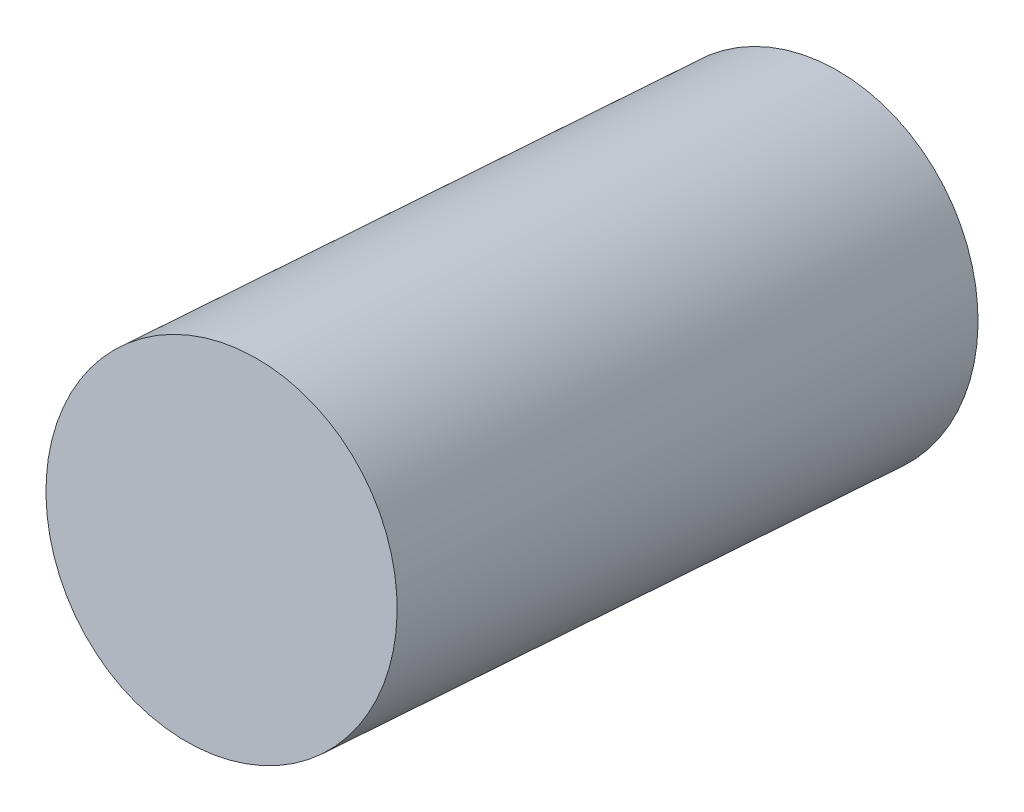
ISO-10303-21;
HEADER;
FILE_DESCRIPTION(('STEP AP214'),'2;1');
FILE_NAME('part.step','',(''),(''),'','','');
FILE_SCHEMA(('AUTOMOTIVE_DESIGN { 1 0 10303 214 1 1 1 1 }'));
ENDSEC;
DATA;
#1=APPLICATION_CONTEXT('core data for automotive mechanical design processes');
#2=APPLICATION_PROTOCOL_DEFINITION('international standard','automotive_design',2000,#1);
#3=PRODUCT_CONTEXT('',#1,'mechanical');
#4=PRODUCT('Part','Part','',(#3));
#5=PRODUCT_RELATED_PRODUCT_CATEGORY('part','',(#4));
#6=PRODUCT_DEFINITION_FORMATION('','',#4);
#7=PRODUCT_DEFINITION_CONTEXT('part definition',#1,'design');
#8=PRODUCT_DEFINITION('design','',#6,#7);
#9=PRODUCT_DEFINITION_SHAPE('','',#8);
#10=(LENGTH_UNIT() NAMED_UNIT(*) SI_UNIT(.MILLI.,.METRE.));
#11=(NAMED_UNIT(*) PLANE_ANGLE_UNIT() SI_UNIT($,.RADIAN.));
#12=(NAMED_UNIT(*) SI_UNIT($,.STERADIAN.) SOLID_ANGLE_UNIT());
#13=UNCERTAINTY_MEASURE_WITH_UNIT(LENGTH_MEASURE(1.E-05),#10,'distance_accuracy_value','');
#14=(GEOMETRIC_REPRESENTATION_CONTEXT(3) GLOBAL_UNCERTAINTY_ASSIGNED_CONTEXT((#13)) GLOBAL_UNIT_ASSIGNED_CONTEXT((#10,
#11,#12)) REPRESENTATION_CONTEXT('',''));
#15=CARTESIAN_POINT('',(0.,0.,0.));
#16=DIRECTION('',(0.,0.,1.));
#17=DIRECTION('',(1.,0.,0.));
#18=AXIS2_PLACEMENT_3D('',#15,#16,#17);
#19=CARTESIAN_POINT('',(-5.5578421519103,-9.6264649875564,4.48352085995661));
#20=DIRECTION('',(-0.086824088833465,-0.150383733180432,-0.984807753012209));
#21=DIRECTION('',(-0.492403876506111,-0.85286853195244,0.173648177666927));
#22=AXIS2_PLACEMENT_3D('',#19,#20,#21);
#23=PLANE('',#22);
#24=CARTESIAN_POINT('',(-5.5578421519103,-9.6264649875564,4.48352085995661));
#25=DIRECTION('',(0.0868240888334649,0.150383733180432,0.984807753012209));
#26=DIRECTION('',(0.492403876506111,0.85286853195244,-0.173648177666927));
#27=AXIS2_PLACEMENT_3D('',#24,#25,#26);
#28=CIRCLE('',#27,1.93220030269667);
#29=CARTESIAN_POINT('',(-4.60641923267618,-7.97855215195743,4.14799779850585));
#30=VERTEX_POINT('',#29);
#31=EDGE_CURVE('E10',#30,#30,#28,.T.);
#32=ORIENTED_EDGE('',*,*,#31,.T.);
#33=EDGE_LOOP('',(#32));
#34=FACE_BOUND('',#33,.T.);
#35=ADVANCED_FACE('F15',(#34),#23,.F.);
#36=CARTESIAN_POINT('',(-5.46326660671938,-9.46265533813221,5.55625000000001));
#37=DIRECTION('',(0.0868240888334649,0.150383733180432,0.984807753012209));
#38=DIRECTION('',(0.492403876506111,0.85286853195244,-0.173648177666927));
#39=AXIS2_PLACEMENT_3D('',#36,#37,#38);
#40=CYLINDRICAL_SURFACE('',#39,1.93220030269667);
#41=ORIENTED_EDGE('',*,*,#31,.F.);
#42=EDGE_LOOP('',(#41));
#43=FACE_BOUND('',#42,.T.);
#44=CARTESIAN_POINT('',(-6.23304408187477,-10.7959490356234,-3.175));
#45=DIRECTION('',(0.0868240888334649,0.150383733180432,0.984807753012209));
#46=DIRECTION('',(0.492403876506111,0.85286853195244,-0.173648177666927));
#47=AXIS2_PLACEMENT_3D('',#44,#45,#46);
#48=CIRCLE('',#47,1.93220030269668);
#49=CARTESIAN_POINT('',(-5.28162116264064,-9.14803620002442,-3.51052306145076));
#50=VERTEX_POINT('',#49);
#51=EDGE_CURVE('E19',#50,#50,#48,.T.);
#52=ORIENTED_EDGE('',*,*,#51,.T.);
#53=EDGE_LOOP('',(#52));
#54=FACE_BOUND('',#53,.T.);
#55=ADVANCED_FACE('F28',(#43,#54),#40,.T.);
#56=CARTESIAN_POINT('',(-7.1844670011089,-12.4438618712224,-2.83947693854923));
#57=DIRECTION('',(0.086824088833465,0.150383733180432,0.984807753012209));
#58=DIRECTION('',(0.492403876506111,0.85286853195244,-0.173648177666927));
#59=AXIS2_PLACEMENT_3D('',#56,#57,#58);
#60=PLANE('',#59);
#61=ORIENTED_EDGE('',*,*,#51,.F.);
#62=EDGE_LOOP('',(#61));
#63=FACE_BOUND('',#62,.T.);
#64=ADVANCED_FACE('F17',(#63),#60,.F.);
#65=CLOSED_SHELL('',(#35,#55,#64));
#66=MANIFOLD_SOLID_BREP('B1',#65);
#67=ADVANCED_BREP_SHAPE_REPRESENTATION('',(#18,#66),#14);
#68=SHAPE_DEFINITION_REPRESENTATION(#9,#67);
ENDSEC;
END-ISO-10303-21;
